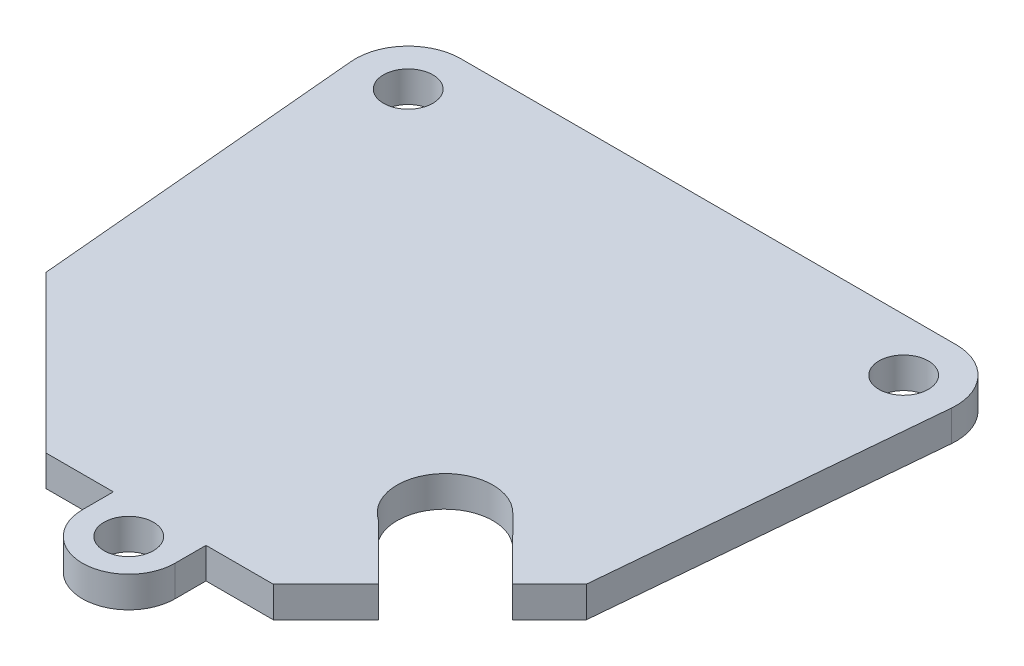
ISO-10303-21;
HEADER;
FILE_DESCRIPTION(('STEP AP214'),'2;1');
FILE_NAME('part.step','',(''),(''),'','','');
FILE_SCHEMA(('AUTOMOTIVE_DESIGN { 1 0 10303 214 1 1 1 1 }'));
ENDSEC;
DATA;
#1=APPLICATION_CONTEXT('core data for automotive mechanical design processes');
#2=APPLICATION_PROTOCOL_DEFINITION('international standard','automotive_design',2000,#1);
#3=PRODUCT_CONTEXT('',#1,'mechanical');
#4=PRODUCT('Part','Part','',(#3));
#5=PRODUCT_RELATED_PRODUCT_CATEGORY('part','',(#4));
#6=PRODUCT_DEFINITION_FORMATION('','',#4);
#7=PRODUCT_DEFINITION_CONTEXT('part definition',#1,'design');
#8=PRODUCT_DEFINITION('design','',#6,#7);
#9=PRODUCT_DEFINITION_SHAPE('','',#8);
#10=(LENGTH_UNIT() NAMED_UNIT(*) SI_UNIT(.MILLI.,.METRE.));
#11=(NAMED_UNIT(*) PLANE_ANGLE_UNIT() SI_UNIT($,.RADIAN.));
#12=(NAMED_UNIT(*) SI_UNIT($,.STERADIAN.) SOLID_ANGLE_UNIT());
#13=UNCERTAINTY_MEASURE_WITH_UNIT(LENGTH_MEASURE(1.E-05),#10,'distance_accuracy_value','');
#14=(GEOMETRIC_REPRESENTATION_CONTEXT(3) GLOBAL_UNCERTAINTY_ASSIGNED_CONTEXT((#13)) GLOBAL_UNIT_ASSIGNED_CONTEXT((#10,
#11,#12)) REPRESENTATION_CONTEXT('',''));
#15=CARTESIAN_POINT('',(0.,0.,0.));
#16=DIRECTION('',(0.,0.,1.));
#17=DIRECTION('',(1.,0.,0.));
#18=AXIS2_PLACEMENT_3D('',#15,#16,#17);
#19=CARTESIAN_POINT('',(5.3391852037626,2.,-8.32651563651009));
#20=DIRECTION('',(0.,-1.,0.));
#21=DIRECTION('',(0.,0.,-1.));
#22=AXIS2_PLACEMENT_3D('',#19,#20,#21);
#23=CYLINDRICAL_SURFACE('',#22,3.10491666638313);
#24=CARTESIAN_POINT('',(5.3391852037626,0.,-8.32651563651009));
#25=DIRECTION('',(0.,1.,0.));
#26=DIRECTION('',(0.,0.,1.));
#27=AXIS2_PLACEMENT_3D('',#24,#25,#26);
#28=CIRCLE('',#27,3.10491666638313);
#29=CARTESIAN_POINT('',(7.53658586619675,0.,-10.5201286000745));
#30=VERTEX_POINT('',#29);
#31=CARTESIAN_POINT('',(3.56551399816186,0.,-5.77806552720707));
#32=VERTEX_POINT('',#31);
#33=EDGE_CURVE('E201',#30,#32,#28,.T.);
#34=ORIENTED_EDGE('',*,*,#33,.F.);
#35=DIRECTION('',(0.,-1.,0.));
#36=VECTOR('',#35,1.);
#37=CARTESIAN_POINT('',(7.53658586619675,2.,-10.5201286000745));
#38=LINE('',#37,#36);
#39=CARTESIAN_POINT('',(7.53658586619675,2.,-10.5201286000745));
#40=VERTEX_POINT('',#39);
#41=EDGE_CURVE('E11',#40,#30,#38,.T.);
#42=ORIENTED_EDGE('',*,*,#41,.F.);
#43=CARTESIAN_POINT('',(5.3391852037626,2.,-8.32651563651009));
#44=DIRECTION('',(0.,1.,0.));
#45=DIRECTION('',(0.,0.,1.));
#46=AXIS2_PLACEMENT_3D('',#43,#44,#45);
#47=CIRCLE('',#46,3.10491666638313);
#48=CARTESIAN_POINT('',(3.56551399816186,2.,-5.77806552720707));
#49=VERTEX_POINT('',#48);
#50=EDGE_CURVE('E267',#40,#49,#47,.T.);
#51=ORIENTED_EDGE('',*,*,#50,.T.);
#52=DIRECTION('',(0.,-1.,0.));
#53=VECTOR('',#52,1.);
#54=CARTESIAN_POINT('',(3.56551399816186,2.,-5.77806552720707));
#55=LINE('',#54,#53);
#56=EDGE_CURVE('E58',#49,#32,#55,.T.);
#57=ORIENTED_EDGE('',*,*,#56,.T.);
#58=EDGE_LOOP('',(#34,#42,#51,#57));
#59=FACE_BOUND('',#58,.T.);
#60=ADVANCED_FACE('F41',(#59),#23,.F.);
#61=CARTESIAN_POINT('',(9.03485047747386,2.,-9.01927694392251));
#62=DIRECTION('',(0.707716469889632,0.,-0.706496566337698));
#63=DIRECTION('',(-0.706496566337698,0.,-0.707716469889632));
#64=AXIS2_PLACEMENT_3D('',#61,#62,#63);
#65=PLANE('',#64);
#66=DIRECTION('',(0.706496566337698,0.,0.707716469889632));
#67=VECTOR('',#66,1.);
#68=CARTESIAN_POINT('',(9.03485047747386,0.,-9.01927694392251));
#69=LINE('',#68,#67);
#70=CARTESIAN_POINT('',(11.5457498374629,0.,-6.50404202847044));
#71=VERTEX_POINT('',#70);
#72=EDGE_CURVE('E204',#30,#71,#69,.T.);
#73=ORIENTED_EDGE('',*,*,#72,.T.);
#74=DIRECTION('',(0.,-1.,0.));
#75=VECTOR('',#74,1.);
#76=CARTESIAN_POINT('',(11.5457498374629,2.,-6.50404202847044));
#77=LINE('',#76,#75);
#78=CARTESIAN_POINT('',(11.5457498374629,2.,-6.50404202847044));
#79=VERTEX_POINT('',#78);
#80=EDGE_CURVE('E50',#79,#71,#77,.T.);
#81=ORIENTED_EDGE('',*,*,#80,.F.);
#82=DIRECTION('',(0.706496566337698,0.,0.707716469889632));
#83=VECTOR('',#82,1.);
#84=CARTESIAN_POINT('',(9.03485047747386,2.,-9.01927694392251));
#85=LINE('',#84,#83);
#86=EDGE_CURVE('E585',#40,#79,#85,.T.);
#87=ORIENTED_EDGE('',*,*,#86,.F.);
#88=ORIENTED_EDGE('',*,*,#41,.T.);
#89=EDGE_LOOP('',(#73,#81,#87,#88));
#90=FACE_BOUND('',#89,.T.);
#91=ADVANCED_FACE('F393',(#90),#65,.F.);
#92=CARTESIAN_POINT('',(2.52085390449622,2.,2.52085390449622));
#93=DIRECTION('',(-0.707106781186548,0.,-0.707106781186548));
#94=DIRECTION('',(-0.707106781186548,0.,0.707106781186548));
#95=AXIS2_PLACEMENT_3D('',#92,#93,#94);
#96=PLANE('',#95);
#97=DIRECTION('',(0.707106781186548,0.,-0.707106781186548));
#98=VECTOR('',#97,1.);
#99=CARTESIAN_POINT('',(2.52085390449622,0.,2.52085390449622));
#100=LINE('',#99,#98);
#101=CARTESIAN_POINT('',(13.9292973464366,0.,-8.88758953744415));
#102=VERTEX_POINT('',#101);
#103=EDGE_CURVE('E207',#71,#102,#100,.T.);
#104=ORIENTED_EDGE('',*,*,#103,.T.);
#105=DIRECTION('',(0.,-1.,0.));
#106=VECTOR('',#105,1.);
#107=CARTESIAN_POINT('',(13.9292973464366,2.,-8.88758953744415));
#108=LINE('',#107,#106);
#109=CARTESIAN_POINT('',(13.9292973464366,2.,-8.88758953744415));
#110=VERTEX_POINT('',#109);
#111=EDGE_CURVE('E304',#110,#102,#108,.T.);
#112=ORIENTED_EDGE('',*,*,#111,.F.);
#113=DIRECTION('',(0.707106781186548,0.,-0.707106781186548));
#114=VECTOR('',#113,1.);
#115=CARTESIAN_POINT('',(2.52085390449622,2.,2.52085390449622));
#116=LINE('',#115,#114);
#117=EDGE_CURVE('E315',#79,#110,#116,.T.);
#118=ORIENTED_EDGE('',*,*,#117,.F.);
#119=ORIENTED_EDGE('',*,*,#80,.T.);
#120=EDGE_LOOP('',(#104,#112,#118,#119));
#121=FACE_BOUND('',#120,.T.);
#122=ADVANCED_FACE('F313',(#121),#96,.F.);
#123=CARTESIAN_POINT('',(13.028304826256,2.,1.16741874936931));
#124=DIRECTION('',(-0.996009367124154,0.,-0.0892487568593637));
#125=DIRECTION('',(-0.0892487568593637,0.,0.996009367124154));
#126=AXIS2_PLACEMENT_3D('',#123,#124,#125);
#127=PLANE('',#126);
#128=DIRECTION('',(0.0892487568593637,0.,-0.996009367124154));
#129=VECTOR('',#128,1.);
#130=CARTESIAN_POINT('',(13.028304826256,0.,1.16741874936931));
#131=LINE('',#130,#129);
#132=CARTESIAN_POINT('',(15.8744695482683,0.,-30.5955639885264));
#133=VERTEX_POINT('',#132);
#134=EDGE_CURVE('E210',#102,#133,#131,.T.);
#135=ORIENTED_EDGE('',*,*,#134,.T.);
#136=DIRECTION('',(0.,-1.,0.));
#137=VECTOR('',#136,1.);
#138=CARTESIAN_POINT('',(15.8744695482683,2.,-30.5955639885264));
#139=LINE('',#138,#137);
#140=CARTESIAN_POINT('',(15.8744695482683,2.,-30.5955639885264));
#141=VERTEX_POINT('',#140);
#142=EDGE_CURVE('E300',#141,#133,#139,.T.);
#143=ORIENTED_EDGE('',*,*,#142,.F.);
#144=DIRECTION('',(0.0892487568593637,0.,-0.996009367124154));
#145=VECTOR('',#144,1.);
#146=CARTESIAN_POINT('',(13.028304826256,2.,1.16741874936931));
#147=LINE('',#146,#145);
#148=EDGE_CURVE('E336',#110,#141,#147,.T.);
#149=ORIENTED_EDGE('',*,*,#148,.F.);
#150=ORIENTED_EDGE('',*,*,#111,.T.);
#151=EDGE_LOOP('',(#135,#143,#149,#150));
#152=FACE_BOUND('',#151,.T.);
#153=ADVANCED_FACE('F326',(#152),#127,.F.);
#154=CARTESIAN_POINT('',(12.4792973464366,2.,-30.8997929529707));
#155=DIRECTION('',(0.,-1.,0.));
#156=DIRECTION('',(0.,0.,-1.));
#157=AXIS2_PLACEMENT_3D('',#154,#155,#156);
#158=CYLINDRICAL_SURFACE('',#157,3.4087753729012);
#159=CARTESIAN_POINT('',(12.4792973464366,0.,-30.8997929529707));
#160=DIRECTION('',(0.,1.,0.));
#161=DIRECTION('',(0.,0.,1.));
#162=AXIS2_PLACEMENT_3D('',#159,#160,#161);
#163=CIRCLE('',#162,3.4087753729012);
#164=CARTESIAN_POINT('',(12.4792973464366,0.,-34.3085683258719));
#165=VERTEX_POINT('',#164);
#166=EDGE_CURVE('E213',#133,#165,#163,.T.);
#167=ORIENTED_EDGE('',*,*,#166,.T.);
#168=DIRECTION('',(0.,-1.,0.));
#169=VECTOR('',#168,1.);
#170=CARTESIAN_POINT('',(12.4792973464366,2.,-34.3085683258719));
#171=LINE('',#170,#169);
#172=CARTESIAN_POINT('',(12.4792973464366,2.,-34.3085683258719));
#173=VERTEX_POINT('',#172);
#174=EDGE_CURVE('E296',#173,#165,#171,.T.);
#175=ORIENTED_EDGE('',*,*,#174,.F.);
#176=CARTESIAN_POINT('',(12.4792973464366,2.,-30.8997929529707));
#177=DIRECTION('',(0.,1.,0.));
#178=DIRECTION('',(0.,0.,1.));
#179=AXIS2_PLACEMENT_3D('',#176,#177,#178);
#180=CIRCLE('',#179,3.4087753729012);
#181=EDGE_CURVE('E332',#141,#173,#180,.T.);
#182=ORIENTED_EDGE('',*,*,#181,.F.);
#183=ORIENTED_EDGE('',*,*,#142,.T.);
#184=EDGE_LOOP('',(#167,#175,#182,#183));
#185=FACE_BOUND('',#184,.T.);
#186=ADVANCED_FACE('F330',(#185),#158,.T.);
#187=CARTESIAN_POINT('',(0.,2.,-34.3085683258719));
#188=DIRECTION('',(0.,0.,1.));
#189=DIRECTION('',(1.,0.,0.));
#190=AXIS2_PLACEMENT_3D('',#187,#188,#189);
#191=PLANE('',#190);
#192=DIRECTION('',(-1.,0.,0.));
#193=VECTOR('',#192,1.);
#194=CARTESIAN_POINT('',(0.,0.,-34.3085683258719));
#195=LINE('',#194,#193);
#196=CARTESIAN_POINT('',(-19.6207026535634,0.,-34.3085683258719));
#197=VERTEX_POINT('',#196);
#198=EDGE_CURVE('E216',#165,#197,#195,.T.);
#199=ORIENTED_EDGE('',*,*,#198,.T.);
#200=DIRECTION('',(0.,-1.,0.));
#201=VECTOR('',#200,1.);
#202=CARTESIAN_POINT('',(-19.6207026535634,2.,-34.3085683258719));
#203=LINE('',#202,#201);
#204=CARTESIAN_POINT('',(-19.6207026535634,2.,-34.3085683258719));
#205=VERTEX_POINT('',#204);
#206=EDGE_CURVE('E293',#205,#197,#203,.T.);
#207=ORIENTED_EDGE('',*,*,#206,.F.);
#208=DIRECTION('',(-1.,0.,0.));
#209=VECTOR('',#208,1.);
#210=CARTESIAN_POINT('',(0.,2.,-34.3085683258719));
#211=LINE('',#210,#209);
#212=EDGE_CURVE('E335',#173,#205,#211,.T.);
#213=ORIENTED_EDGE('',*,*,#212,.F.);
#214=ORIENTED_EDGE('',*,*,#174,.T.);
#215=EDGE_LOOP('',(#199,#207,#213,#214));
#216=FACE_BOUND('',#215,.T.);
#217=ADVANCED_FACE('F406',(#216),#191,.F.);
#218=CARTESIAN_POINT('',(-19.6207026535634,2.,-30.8997929529707));
#219=DIRECTION('',(0.,-1.,0.));
#220=DIRECTION('',(0.,0.,-1.));
#221=AXIS2_PLACEMENT_3D('',#218,#219,#220);
#222=CYLINDRICAL_SURFACE('',#221,3.4087753729012);
#223=CARTESIAN_POINT('',(-19.6207026535634,0.,-30.8997929529707));
#224=DIRECTION('',(0.,1.,0.));
#225=DIRECTION('',(0.,0.,1.));
#226=AXIS2_PLACEMENT_3D('',#223,#224,#225);
#227=CIRCLE('',#226,3.4087753729012);
#228=CARTESIAN_POINT('',(-23.0158748553951,0.,-30.5955639885264));
#229=VERTEX_POINT('',#228);
#230=EDGE_CURVE('E220',#229,#197,#227,.F.);
#231=ORIENTED_EDGE('',*,*,#230,.F.);
#232=DIRECTION('',(0.,-1.,0.));
#233=VECTOR('',#232,1.);
#234=CARTESIAN_POINT('',(-23.0158748553951,2.,-30.5955639885264));
#235=LINE('',#234,#233);
#236=CARTESIAN_POINT('',(-23.0158748553951,2.,-30.5955639885264));
#237=VERTEX_POINT('',#236);
#238=EDGE_CURVE('E290',#237,#229,#235,.T.);
#239=ORIENTED_EDGE('',*,*,#238,.F.);
#240=CARTESIAN_POINT('',(-19.6207026535634,2.,-30.8997929529707));
#241=DIRECTION('',(0.,1.,0.));
#242=DIRECTION('',(0.,0.,1.));
#243=AXIS2_PLACEMENT_3D('',#240,#241,#242);
#244=CIRCLE('',#243,3.4087753729012);
#245=EDGE_CURVE('E340',#237,#205,#244,.F.);
#246=ORIENTED_EDGE('',*,*,#245,.T.);
#247=ORIENTED_EDGE('',*,*,#206,.T.);
#248=EDGE_LOOP('',(#231,#239,#246,#247));
#249=FACE_BOUND('',#248,.T.);
#250=ADVANCED_FACE('F409',(#249),#222,.T.);
#251=CARTESIAN_POINT('',(-20.1128264077421,2.,1.80223681932041));
#252=DIRECTION('',(-0.996009367124154,0.,0.0892487568593637));
#253=DIRECTION('',(0.0892487568593637,0.,0.996009367124154));
#254=AXIS2_PLACEMENT_3D('',#251,#252,#253);
#255=PLANE('',#254);
#256=DIRECTION('',(-0.0892487568593637,0.,-0.996009367124154));
#257=VECTOR('',#256,1.);
#258=CARTESIAN_POINT('',(-20.1128264077421,0.,1.80223681932041));
#259=LINE('',#258,#257);
#260=CARTESIAN_POINT('',(-21.0707026535634,0.,-8.88758953744415));
#261=VERTEX_POINT('',#260);
#262=EDGE_CURVE('E224',#261,#229,#259,.T.);
#263=ORIENTED_EDGE('',*,*,#262,.F.);
#264=DIRECTION('',(0.,-1.,0.));
#265=VECTOR('',#264,1.);
#266=CARTESIAN_POINT('',(-21.0707026535634,2.,-8.88758953744415));
#267=LINE('',#266,#265);
#268=CARTESIAN_POINT('',(-21.0707026535634,2.,-8.88758953744415));
#269=VERTEX_POINT('',#268);
#270=EDGE_CURVE('E287',#269,#261,#267,.T.);
#271=ORIENTED_EDGE('',*,*,#270,.F.);
#272=DIRECTION('',(-0.0892487568593637,0.,-0.996009367124154));
#273=VECTOR('',#272,1.);
#274=CARTESIAN_POINT('',(-20.1128264077421,2.,1.80223681932041));
#275=LINE('',#274,#273);
#276=EDGE_CURVE('E348',#269,#237,#275,.T.);
#277=ORIENTED_EDGE('',*,*,#276,.T.);
#278=ORIENTED_EDGE('',*,*,#238,.T.);
#279=EDGE_LOOP('',(#263,#271,#277,#278));
#280=FACE_BOUND('',#279,.T.);
#281=ADVANCED_FACE('F413',(#280),#255,.T.);
#282=CARTESIAN_POINT('',(-6.09155655805963,2.,6.09155655805963));
#283=DIRECTION('',(-0.707106781186548,0.,0.707106781186548));
#284=DIRECTION('',(0.707106781186548,0.,0.707106781186548));
#285=AXIS2_PLACEMENT_3D('',#282,#283,#284);
#286=PLANE('',#285);
#287=DIRECTION('',(-0.707106781186548,0.,-0.707106781186548));
#288=VECTOR('',#287,1.);
#289=CARTESIAN_POINT('',(-6.09155655805963,0.,6.09155655805963));
#290=LINE('',#289,#288);
#291=CARTESIAN_POINT('',(-10.9347783930018,0.,1.24833472311749));
#292=VERTEX_POINT('',#291);
#293=EDGE_CURVE('E228',#292,#261,#290,.T.);
#294=ORIENTED_EDGE('',*,*,#293,.F.);
#295=DIRECTION('',(0.,-1.,0.));
#296=VECTOR('',#295,1.);
#297=CARTESIAN_POINT('',(-10.9347783930018,2.,1.24833472311749));
#298=LINE('',#297,#296);
#299=CARTESIAN_POINT('',(-10.9347783930018,2.,1.24833472311749));
#300=VERTEX_POINT('',#299);
#301=EDGE_CURVE('E284',#300,#292,#298,.T.);
#302=ORIENTED_EDGE('',*,*,#301,.F.);
#303=DIRECTION('',(-0.707106781186548,0.,-0.707106781186548));
#304=VECTOR('',#303,1.);
#305=CARTESIAN_POINT('',(-6.09155655805963,2.,6.09155655805963));
#306=LINE('',#305,#304);
#307=EDGE_CURVE('E352',#300,#269,#306,.T.);
#308=ORIENTED_EDGE('',*,*,#307,.T.);
#309=ORIENTED_EDGE('',*,*,#270,.T.);
#310=EDGE_LOOP('',(#294,#302,#308,#309));
#311=FACE_BOUND('',#310,.T.);
#312=ADVANCED_FACE('F417',(#311),#286,.T.);
#313=CARTESIAN_POINT('',(0.,2.,1.24833472311751));
#314=DIRECTION('',(0.,0.,1.));
#315=DIRECTION('',(1.,0.,0.));
#316=AXIS2_PLACEMENT_3D('',#313,#314,#315);
#317=PLANE('',#316);
#318=DIRECTION('',(-1.,0.,0.));
#319=VECTOR('',#318,1.);
#320=CARTESIAN_POINT('',(0.,0.,1.24833472311751));
#321=LINE('',#320,#319);
#322=CARTESIAN_POINT('',(-6.5707026535634,0.,1.2483347231175));
#323=VERTEX_POINT('',#322);
#324=EDGE_CURVE('E232',#323,#292,#321,.T.);
#325=ORIENTED_EDGE('',*,*,#324,.F.);
#326=DIRECTION('',(0.,-1.,0.));
#327=VECTOR('',#326,1.);
#328=CARTESIAN_POINT('',(-6.5707026535634,2.,1.2483347231175));
#329=LINE('',#328,#327);
#330=CARTESIAN_POINT('',(-6.5707026535634,2.,1.2483347231175));
#331=VERTEX_POINT('',#330);
#332=EDGE_CURVE('E281',#331,#323,#329,.T.);
#333=ORIENTED_EDGE('',*,*,#332,.F.);
#334=DIRECTION('',(-1.,0.,0.));
#335=VECTOR('',#334,1.);
#336=CARTESIAN_POINT('',(0.,2.,1.24833472311751));
#337=LINE('',#336,#335);
#338=EDGE_CURVE('E356',#331,#300,#337,.T.);
#339=ORIENTED_EDGE('',*,*,#338,.T.);
#340=ORIENTED_EDGE('',*,*,#301,.T.);
#341=EDGE_LOOP('',(#325,#333,#339,#340));
#342=FACE_BOUND('',#341,.T.);
#343=ADVANCED_FACE('F421',(#342),#317,.T.);
#344=CARTESIAN_POINT('',(-6.5707026535634,2.,0.));
#345=DIRECTION('',(-1.,0.,0.));
#346=DIRECTION('',(0.,0.,1.));
#347=AXIS2_PLACEMENT_3D('',#344,#345,#346);
#348=PLANE('',#347);
#349=DIRECTION('',(0.,0.,-1.));
#350=VECTOR('',#349,1.);
#351=CARTESIAN_POINT('',(-6.5707026535634,0.,0.));
#352=LINE('',#351,#350);
#353=CARTESIAN_POINT('',(-6.57070265356341,0.,3.25304747644496));
#354=VERTEX_POINT('',#353);
#355=EDGE_CURVE('E236',#354,#323,#352,.T.);
#356=ORIENTED_EDGE('',*,*,#355,.F.);
#357=DIRECTION('',(0.,-1.,0.));
#358=VECTOR('',#357,1.);
#359=CARTESIAN_POINT('',(-6.57070265356341,2.,3.25304747644496));
#360=LINE('',#359,#358);
#361=CARTESIAN_POINT('',(-6.57070265356341,2.,3.25304747644496));
#362=VERTEX_POINT('',#361);
#363=EDGE_CURVE('E278',#362,#354,#360,.T.);
#364=ORIENTED_EDGE('',*,*,#363,.F.);
#365=DIRECTION('',(0.,0.,-1.));
#366=VECTOR('',#365,1.);
#367=CARTESIAN_POINT('',(-6.5707026535634,2.,0.));
#368=LINE('',#367,#366);
#369=EDGE_CURVE('E360',#362,#331,#368,.T.);
#370=ORIENTED_EDGE('',*,*,#369,.T.);
#371=ORIENTED_EDGE('',*,*,#332,.T.);
#372=EDGE_LOOP('',(#356,#364,#370,#371));
#373=FACE_BOUND('',#372,.T.);
#374=ADVANCED_FACE('F425',(#373),#348,.T.);
#375=CARTESIAN_POINT('',(-3.57070265356341,2.,3.25304747644496));
#376=DIRECTION('',(0.,-1.,0.));
#377=DIRECTION('',(0.,0.,-1.));
#378=AXIS2_PLACEMENT_3D('',#375,#376,#377);
#379=CYLINDRICAL_SURFACE('',#378,3.);
#380=CARTESIAN_POINT('',(-3.57070265356341,0.,3.25304747644496));
#381=DIRECTION('',(0.,1.,0.));
#382=DIRECTION('',(0.,0.,1.));
#383=AXIS2_PLACEMENT_3D('',#380,#381,#382);
#384=CIRCLE('',#383,3.);
#385=CARTESIAN_POINT('',(-0.570702653563407,0.,3.25304747644496));
#386=VERTEX_POINT('',#385);
#387=EDGE_CURVE('E240',#354,#386,#384,.T.);
#388=ORIENTED_EDGE('',*,*,#387,.T.);
#389=DIRECTION('',(0.,-1.,0.));
#390=VECTOR('',#389,1.);
#391=CARTESIAN_POINT('',(-0.570702653563407,2.,3.25304747644496));
#392=LINE('',#391,#390);
#393=CARTESIAN_POINT('',(-0.570702653563407,2.,3.25304747644496));
#394=VERTEX_POINT('',#393);
#395=EDGE_CURVE('E274',#394,#386,#392,.T.);
#396=ORIENTED_EDGE('',*,*,#395,.F.);
#397=CARTESIAN_POINT('',(-3.57070265356341,2.,3.25304747644496));
#398=DIRECTION('',(0.,1.,0.));
#399=DIRECTION('',(0.,0.,1.));
#400=AXIS2_PLACEMENT_3D('',#397,#398,#399);
#401=CIRCLE('',#400,3.);
#402=EDGE_CURVE('E364',#362,#394,#401,.T.);
#403=ORIENTED_EDGE('',*,*,#402,.F.);
#404=ORIENTED_EDGE('',*,*,#363,.T.);
#405=EDGE_LOOP('',(#388,#396,#403,#404));
#406=FACE_BOUND('',#405,.T.);
#407=ADVANCED_FACE('F372',(#406),#379,.T.);
#408=CARTESIAN_POINT('',(-0.570702653563413,2.,0.));
#409=DIRECTION('',(-1.,0.,0.));
#410=DIRECTION('',(0.,0.,1.));
#411=AXIS2_PLACEMENT_3D('',#408,#409,#410);
#412=PLANE('',#411);
#413=DIRECTION('',(0.,0.,-1.));
#414=VECTOR('',#413,1.);
#415=CARTESIAN_POINT('',(-0.570702653563413,0.,0.));
#416=LINE('',#415,#414);
#417=CARTESIAN_POINT('',(-0.570702653563411,0.,1.2483347231175));
#418=VERTEX_POINT('',#417);
#419=EDGE_CURVE('E243',#386,#418,#416,.T.);
#420=ORIENTED_EDGE('',*,*,#419,.T.);
#421=DIRECTION('',(0.,-1.,0.));
#422=VECTOR('',#421,1.);
#423=CARTESIAN_POINT('',(-0.570702653563411,2.,1.2483347231175));
#424=LINE('',#423,#422);
#425=CARTESIAN_POINT('',(-0.570702653563411,2.,1.2483347231175));
#426=VERTEX_POINT('',#425);
#427=EDGE_CURVE('E179',#426,#418,#424,.T.);
#428=ORIENTED_EDGE('',*,*,#427,.F.);
#429=DIRECTION('',(0.,0.,-1.));
#430=VECTOR('',#429,1.);
#431=CARTESIAN_POINT('',(-0.570702653563413,2.,0.));
#432=LINE('',#431,#430);
#433=EDGE_CURVE('E165',#394,#426,#432,.T.);
#434=ORIENTED_EDGE('',*,*,#433,.F.);
#435=ORIENTED_EDGE('',*,*,#395,.T.);
#436=EDGE_LOOP('',(#420,#428,#434,#435));
#437=FACE_BOUND('',#436,.T.);
#438=ADVANCED_FACE('F376',(#437),#412,.F.);
#439=CARTESIAN_POINT('',(0.,2.,1.2483347231175));
#440=DIRECTION('',(0.,0.,-1.));
#441=DIRECTION('',(-1.,0.,0.));
#442=AXIS2_PLACEMENT_3D('',#439,#440,#441);
#443=PLANE('',#442);
#444=DIRECTION('',(1.,0.,0.));
#445=VECTOR('',#444,1.);
#446=CARTESIAN_POINT('',(0.,0.,1.2483347231175));
#447=LINE('',#446,#445);
#448=CARTESIAN_POINT('',(3.79337308587496,0.,1.24833472311749));
#449=VERTEX_POINT('',#448);
#450=EDGE_CURVE('E175',#418,#449,#447,.T.);
#451=ORIENTED_EDGE('',*,*,#450,.T.);
#452=DIRECTION('',(0.,-1.,0.));
#453=VECTOR('',#452,1.);
#454=CARTESIAN_POINT('',(3.79337308587496,2.,1.24833472311749));
#455=LINE('',#454,#453);
#456=CARTESIAN_POINT('',(3.79337308587496,2.,1.24833472311749));
#457=VERTEX_POINT('',#456);
#458=EDGE_CURVE('E172',#457,#449,#455,.T.);
#459=ORIENTED_EDGE('',*,*,#458,.F.);
#460=DIRECTION('',(1.,0.,0.));
#461=VECTOR('',#460,1.);
#462=CARTESIAN_POINT('',(0.,2.,1.2483347231175));
#463=LINE('',#462,#461);
#464=EDGE_CURVE('E156',#426,#457,#463,.T.);
#465=ORIENTED_EDGE('',*,*,#464,.F.);
#466=ORIENTED_EDGE('',*,*,#427,.T.);
#467=EDGE_LOOP('',(#451,#459,#465,#466));
#468=FACE_BOUND('',#467,.T.);
#469=ADVANCED_FACE('F173',(#468),#443,.F.);
#470=CARTESIAN_POINT('',(2.52085390449622,2.,2.52085390449623));
#471=DIRECTION('',(-0.707106781186547,0.,-0.707106781186548));
#472=DIRECTION('',(-0.707106781186548,0.,0.707106781186547));
#473=AXIS2_PLACEMENT_3D('',#470,#471,#472);
#474=PLANE('',#473);
#475=DIRECTION('',(0.707106781186548,0.,-0.707106781186547));
#476=VECTOR('',#475,1.);
#477=CARTESIAN_POINT('',(2.52085390449622,0.,2.52085390449623));
#478=LINE('',#477,#476);
#479=CARTESIAN_POINT('',(7.1926436671807,0.,-2.15093585818824));
#480=VERTEX_POINT('',#479);
#481=EDGE_CURVE('E248',#449,#480,#478,.T.);
#482=ORIENTED_EDGE('',*,*,#481,.T.);
#483=DIRECTION('',(0.,-1.,0.));
#484=VECTOR('',#483,1.);
#485=CARTESIAN_POINT('',(7.1926436671807,2.,-2.15093585818824));
#486=LINE('',#485,#484);
#487=CARTESIAN_POINT('',(7.1926436671807,2.,-2.15093585818824));
#488=VERTEX_POINT('',#487);
#489=EDGE_CURVE('E108',#488,#480,#486,.T.);
#490=ORIENTED_EDGE('',*,*,#489,.F.);
#491=DIRECTION('',(0.707106781186548,0.,-0.707106781186547));
#492=VECTOR('',#491,1.);
#493=CARTESIAN_POINT('',(2.52085390449622,2.,2.52085390449623));
#494=LINE('',#493,#492);
#495=EDGE_CURVE('E163',#457,#488,#494,.T.);
#496=ORIENTED_EDGE('',*,*,#495,.F.);
#497=ORIENTED_EDGE('',*,*,#458,.T.);
#498=EDGE_LOOP('',(#482,#490,#496,#497));
#499=FACE_BOUND('',#498,.T.);
#500=ADVANCED_FACE('F181',(#499),#474,.F.);
#501=CARTESIAN_POINT('',(12.4792973464366,2.,-30.8997929529707));
#502=DIRECTION('',(0.,-1.,0.));
#503=DIRECTION('',(0.,0.,-1.));
#504=AXIS2_PLACEMENT_3D('',#501,#502,#503);
#505=CYLINDRICAL_SURFACE('',#504,1.6);
#506=CARTESIAN_POINT('',(12.4792973464366,2.,-30.8997929529707));
#507=DIRECTION('',(0.,1.,0.));
#508=DIRECTION('',(0.,0.,1.));
#509=AXIS2_PLACEMENT_3D('',#506,#507,#508);
#510=CIRCLE('',#509,1.6);
#511=CARTESIAN_POINT('',(12.4792973464366,2.,-29.2997929529707));
#512=VERTEX_POINT('',#511);
#513=EDGE_CURVE('E193',#512,#512,#510,.T.);
#514=ORIENTED_EDGE('',*,*,#513,.T.);
#515=EDGE_LOOP('',(#514));
#516=FACE_BOUND('',#515,.T.);
#517=CARTESIAN_POINT('',(12.4792973464366,0.,-30.8997929529707));
#518=DIRECTION('',(0.,1.,0.));
#519=DIRECTION('',(0.,0.,1.));
#520=AXIS2_PLACEMENT_3D('',#517,#518,#519);
#521=CIRCLE('',#520,1.6);
#522=CARTESIAN_POINT('',(12.4792973464366,0.,-29.2997929529707));
#523=VERTEX_POINT('',#522);
#524=EDGE_CURVE('E259',#523,#523,#521,.T.);
#525=ORIENTED_EDGE('',*,*,#524,.F.);
#526=EDGE_LOOP('',(#525));
#527=FACE_BOUND('',#526,.T.);
#528=ADVANCED_FACE('F388',(#516,#527),#505,.F.);
#529=CARTESIAN_POINT('',(-19.6207026535634,2.,-30.8997929529707));
#530=DIRECTION('',(0.,-1.,0.));
#531=DIRECTION('',(0.,0.,-1.));
#532=AXIS2_PLACEMENT_3D('',#529,#530,#531);
#533=CYLINDRICAL_SURFACE('',#532,1.6);
#534=CARTESIAN_POINT('',(-19.6207026535634,2.,-30.8997929529707));
#535=DIRECTION('',(0.,1.,0.));
#536=DIRECTION('',(0.,0.,1.));
#537=AXIS2_PLACEMENT_3D('',#534,#535,#536);
#538=CIRCLE('',#537,1.6);
#539=CARTESIAN_POINT('',(-19.6207026535634,2.,-29.2997929529707));
#540=VERTEX_POINT('',#539);
#541=EDGE_CURVE('E186',#540,#540,#538,.T.);
#542=ORIENTED_EDGE('',*,*,#541,.T.);
#543=EDGE_LOOP('',(#542));
#544=FACE_BOUND('',#543,.T.);
#545=CARTESIAN_POINT('',(-19.6207026535634,0.,-30.8997929529707));
#546=DIRECTION('',(0.,1.,0.));
#547=DIRECTION('',(0.,0.,1.));
#548=AXIS2_PLACEMENT_3D('',#545,#546,#547);
#549=CIRCLE('',#548,1.6);
#550=CARTESIAN_POINT('',(-19.6207026535634,0.,-29.2997929529707));
#551=VERTEX_POINT('',#550);
#552=EDGE_CURVE('E255',#551,#551,#549,.T.);
#553=ORIENTED_EDGE('',*,*,#552,.F.);
#554=EDGE_LOOP('',(#553));
#555=FACE_BOUND('',#554,.T.);
#556=ADVANCED_FACE('F380',(#544,#555),#533,.F.);
#557=CARTESIAN_POINT('',(4.67178976268447,2.,-4.67178976268447));
#558=DIRECTION('',(0.707106781186548,0.,-0.707106781186548));
#559=DIRECTION('',(-0.707106781186548,0.,-0.707106781186548));
#560=AXIS2_PLACEMENT_3D('',#557,#558,#559);
#561=PLANE('',#560);
#562=DIRECTION('',(0.707106781186548,0.,0.707106781186548));
#563=VECTOR('',#562,1.);
#564=CARTESIAN_POINT('',(4.67178976268447,0.,-4.67178976268447));
#565=LINE('',#564,#563);
#566=EDGE_CURVE('E251',#32,#480,#565,.T.);
#567=ORIENTED_EDGE('',*,*,#566,.F.);
#568=ORIENTED_EDGE('',*,*,#56,.F.);
#569=DIRECTION('',(0.707106781186548,0.,0.707106781186548));
#570=VECTOR('',#569,1.);
#571=CARTESIAN_POINT('',(4.67178976268447,2.,-4.67178976268447));
#572=LINE('',#571,#570);
#573=EDGE_CURVE('E183',#49,#488,#572,.T.);
#574=ORIENTED_EDGE('',*,*,#573,.T.);
#575=ORIENTED_EDGE('',*,*,#489,.T.);
#576=EDGE_LOOP('',(#567,#568,#574,#575));
#577=FACE_BOUND('',#576,.T.);
#578=ADVANCED_FACE('F377',(#577),#561,.T.);
#579=CARTESIAN_POINT('',(-3.57070265356341,2.,3.25304747644496));
#580=DIRECTION('',(0.,-1.,0.));
#581=DIRECTION('',(0.,0.,-1.));
#582=AXIS2_PLACEMENT_3D('',#579,#580,#581);
#583=CYLINDRICAL_SURFACE('',#582,1.59999999999999);
#584=CARTESIAN_POINT('',(-3.57070265356341,2.,3.25304747644496));
#585=DIRECTION('',(0.,1.,0.));
#586=DIRECTION('',(0.,0.,1.));
#587=AXIS2_PLACEMENT_3D('',#584,#585,#586);
#588=CIRCLE('',#587,1.59999999999999);
#589=CARTESIAN_POINT('',(-3.57070265356341,2.,4.85304747644495));
#590=VERTEX_POINT('',#589);
#591=EDGE_CURVE('E197',#590,#590,#588,.T.);
#592=ORIENTED_EDGE('',*,*,#591,.T.);
#593=EDGE_LOOP('',(#592));
#594=FACE_BOUND('',#593,.T.);
#595=CARTESIAN_POINT('',(-3.57070265356341,0.,3.25304747644496));
#596=DIRECTION('',(0.,1.,0.));
#597=DIRECTION('',(0.,0.,1.));
#598=AXIS2_PLACEMENT_3D('',#595,#596,#597);
#599=CIRCLE('',#598,1.59999999999999);
#600=CARTESIAN_POINT('',(-3.57070265356341,0.,4.85304747644495));
#601=VERTEX_POINT('',#600);
#602=EDGE_CURVE('E263',#601,#601,#599,.T.);
#603=ORIENTED_EDGE('',*,*,#602,.F.);
#604=EDGE_LOOP('',(#603));
#605=FACE_BOUND('',#604,.T.);
#606=ADVANCED_FACE('F379',(#594,#605),#583,.F.);
#607=CARTESIAN_POINT('',(0.,2.,0.));
#608=DIRECTION('',(0.,1.,0.));
#609=DIRECTION('',(0.,0.,1.));
#610=AXIS2_PLACEMENT_3D('',#607,#608,#609);
#611=PLANE('',#610);
#612=ORIENTED_EDGE('',*,*,#50,.F.);
#613=ORIENTED_EDGE('',*,*,#86,.T.);
#614=ORIENTED_EDGE('',*,*,#117,.T.);
#615=ORIENTED_EDGE('',*,*,#148,.T.);
#616=ORIENTED_EDGE('',*,*,#181,.T.);
#617=ORIENTED_EDGE('',*,*,#212,.T.);
#618=ORIENTED_EDGE('',*,*,#245,.F.);
#619=ORIENTED_EDGE('',*,*,#276,.F.);
#620=ORIENTED_EDGE('',*,*,#307,.F.);
#621=ORIENTED_EDGE('',*,*,#338,.F.);
#622=ORIENTED_EDGE('',*,*,#369,.F.);
#623=ORIENTED_EDGE('',*,*,#402,.T.);
#624=ORIENTED_EDGE('',*,*,#433,.T.);
#625=ORIENTED_EDGE('',*,*,#464,.T.);
#626=ORIENTED_EDGE('',*,*,#495,.T.);
#627=ORIENTED_EDGE('',*,*,#573,.F.);
#628=EDGE_LOOP('',(#612,#613,#614,#615,#616,#617,#618,#619,#620,#621,#622,#623,#624,#625,#626,#627));
#629=FACE_BOUND('',#628,.T.);
#630=ORIENTED_EDGE('',*,*,#541,.F.);
#631=EDGE_LOOP('',(#630));
#632=FACE_BOUND('',#631,.T.);
#633=ORIENTED_EDGE('',*,*,#513,.F.);
#634=EDGE_LOOP('',(#633));
#635=FACE_BOUND('',#634,.T.);
#636=ORIENTED_EDGE('',*,*,#591,.F.);
#637=EDGE_LOOP('',(#636));
#638=FACE_BOUND('',#637,.T.);
#639=ADVANCED_FACE('F159',(#629,#632,#635,#638),#611,.T.);
#640=CARTESIAN_POINT('',(0.,0.,0.));
#641=DIRECTION('',(0.,1.,0.));
#642=DIRECTION('',(0.,0.,1.));
#643=AXIS2_PLACEMENT_3D('',#640,#641,#642);
#644=PLANE('',#643);
#645=ORIENTED_EDGE('',*,*,#33,.T.);
#646=ORIENTED_EDGE('',*,*,#566,.T.);
#647=ORIENTED_EDGE('',*,*,#481,.F.);
#648=ORIENTED_EDGE('',*,*,#450,.F.);
#649=ORIENTED_EDGE('',*,*,#419,.F.);
#650=ORIENTED_EDGE('',*,*,#387,.F.);
#651=ORIENTED_EDGE('',*,*,#355,.T.);
#652=ORIENTED_EDGE('',*,*,#324,.T.);
#653=ORIENTED_EDGE('',*,*,#293,.T.);
#654=ORIENTED_EDGE('',*,*,#262,.T.);
#655=ORIENTED_EDGE('',*,*,#230,.T.);
#656=ORIENTED_EDGE('',*,*,#198,.F.);
#657=ORIENTED_EDGE('',*,*,#166,.F.);
#658=ORIENTED_EDGE('',*,*,#134,.F.);
#659=ORIENTED_EDGE('',*,*,#103,.F.);
#660=ORIENTED_EDGE('',*,*,#72,.F.);
#661=EDGE_LOOP('',(#645,#646,#647,#648,#649,#650,#651,#652,#653,#654,#655,#656,#657,#658,#659,#660));
#662=FACE_BOUND('',#661,.T.);
#663=ORIENTED_EDGE('',*,*,#552,.T.);
#664=EDGE_LOOP('',(#663));
#665=FACE_BOUND('',#664,.T.);
#666=ORIENTED_EDGE('',*,*,#524,.T.);
#667=EDGE_LOOP('',(#666));
#668=FACE_BOUND('',#667,.T.);
#669=ORIENTED_EDGE('',*,*,#602,.T.);
#670=EDGE_LOOP('',(#669));
#671=FACE_BOUND('',#670,.T.);
#672=ADVANCED_FACE('F320',(#662,#665,#668,#671),#644,.F.);
#673=CLOSED_SHELL('',(#60,#91,#122,#153,#186,#217,#250,#281,#312,#343,#374,#407,#438,#469,#500,
#528,#556,#578,#606,#639,#672));
#674=MANIFOLD_SOLID_BREP('B2',#673);
#675=ADVANCED_BREP_SHAPE_REPRESENTATION('',(#18,#674),#14);
#676=SHAPE_DEFINITION_REPRESENTATION(#9,#675);
ENDSEC;
END-ISO-10303-21;
